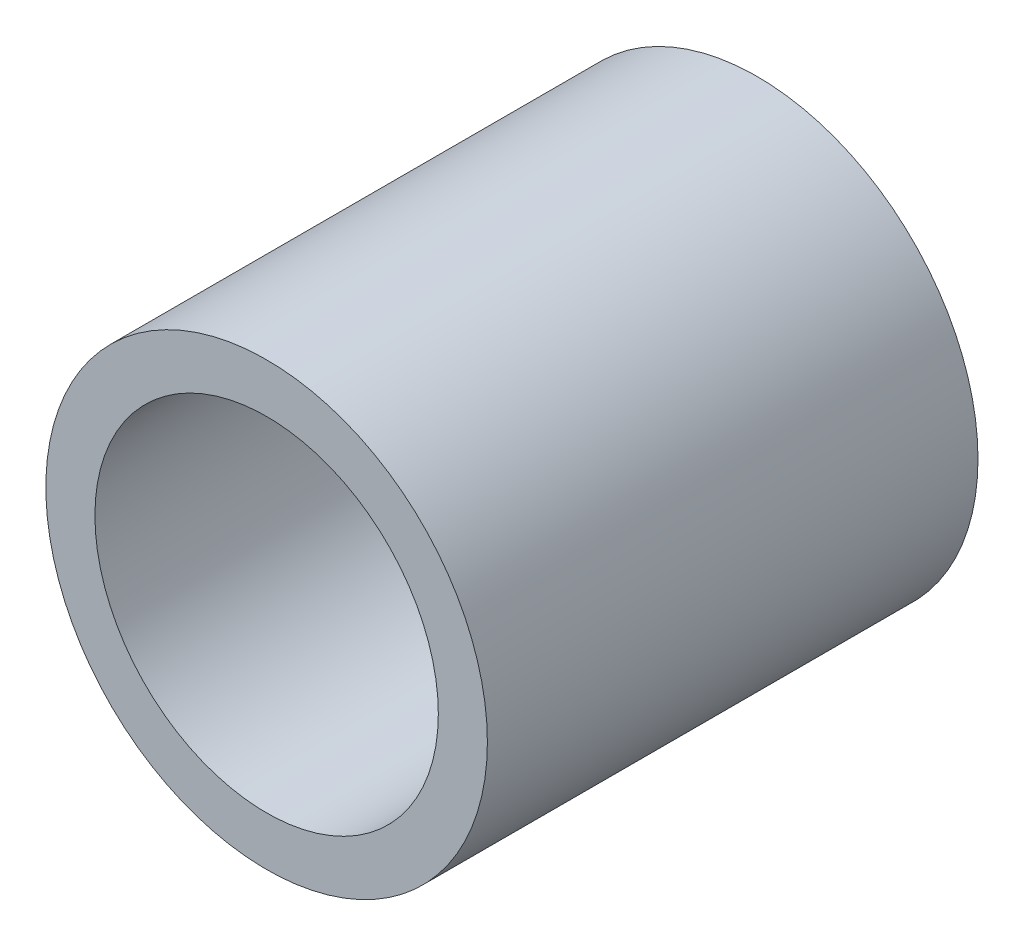
ISO-10303-21;
HEADER;
FILE_DESCRIPTION(('STEP AP214'),'2;1');
FILE_NAME('part.step','',(''),(''),'','','');
FILE_SCHEMA(('AUTOMOTIVE_DESIGN { 1 0 10303 214 1 1 1 1 }'));
ENDSEC;
DATA;
#1=APPLICATION_CONTEXT('core data for automotive mechanical design processes');
#2=APPLICATION_PROTOCOL_DEFINITION('international standard','automotive_design',2000,#1);
#3=PRODUCT_CONTEXT('',#1,'mechanical');
#4=PRODUCT('Part','Part','',(#3));
#5=PRODUCT_RELATED_PRODUCT_CATEGORY('part','',(#4));
#6=PRODUCT_DEFINITION_FORMATION('','',#4);
#7=PRODUCT_DEFINITION_CONTEXT('part definition',#1,'design');
#8=PRODUCT_DEFINITION('design','',#6,#7);
#9=PRODUCT_DEFINITION_SHAPE('','',#8);
#10=(LENGTH_UNIT() NAMED_UNIT(*) SI_UNIT(.MILLI.,.METRE.));
#11=(NAMED_UNIT(*) PLANE_ANGLE_UNIT() SI_UNIT($,.RADIAN.));
#12=(NAMED_UNIT(*) SI_UNIT($,.STERADIAN.) SOLID_ANGLE_UNIT());
#13=UNCERTAINTY_MEASURE_WITH_UNIT(LENGTH_MEASURE(1.E-05),#10,'distance_accuracy_value','');
#14=(GEOMETRIC_REPRESENTATION_CONTEXT(3) GLOBAL_UNCERTAINTY_ASSIGNED_CONTEXT((#13)) GLOBAL_UNIT_ASSIGNED_CONTEXT((#10,
#11,#12)) REPRESENTATION_CONTEXT('',''));
#15=CARTESIAN_POINT('',(0.,0.,0.));
#16=DIRECTION('',(0.,0.,1.));
#17=DIRECTION('',(1.,0.,0.));
#18=AXIS2_PLACEMENT_3D('',#15,#16,#17);
#19=CARTESIAN_POINT('',(0.,0.,15.875));
#20=DIRECTION('',(0.,0.,1.));
#21=DIRECTION('',(1.,0.,0.));
#22=AXIS2_PLACEMENT_3D('',#19,#20,#21);
#23=PLANE('',#22);
#24=CARTESIAN_POINT('',(0.,0.,15.875));
#25=DIRECTION('',(0.,0.,1.));
#26=DIRECTION('',(1.,0.,0.));
#27=AXIS2_PLACEMENT_3D('',#24,#25,#26);
#28=CIRCLE('',#27,14.2875);
#29=CARTESIAN_POINT('',(14.2875,0.,15.875));
#30=VERTEX_POINT('',#29);
#31=EDGE_CURVE('E10',#30,#30,#28,.T.);
#32=ORIENTED_EDGE('',*,*,#31,.T.);
#33=EDGE_LOOP('',(#32));
#34=FACE_BOUND('',#33,.T.);
#35=CARTESIAN_POINT('',(0.,0.,15.875));
#36=DIRECTION('',(0.,0.,1.));
#37=DIRECTION('',(1.,0.,0.));
#38=AXIS2_PLACEMENT_3D('',#35,#36,#37);
#39=CIRCLE('',#38,11.1125);
#40=CARTESIAN_POINT('',(11.1125,0.,15.875));
#41=VERTEX_POINT('',#40);
#42=EDGE_CURVE('E40',#41,#41,#39,.T.);
#43=ORIENTED_EDGE('',*,*,#42,.F.);
#44=EDGE_LOOP('',(#43));
#45=FACE_BOUND('',#44,.T.);
#46=ADVANCED_FACE('F29',(#34,#45),#23,.T.);
#47=CARTESIAN_POINT('',(0.,0.,-15.875));
#48=DIRECTION('',(0.,0.,1.));
#49=DIRECTION('',(1.,0.,0.));
#50=AXIS2_PLACEMENT_3D('',#47,#48,#49);
#51=PLANE('',#50);
#52=CARTESIAN_POINT('',(0.,0.,-15.875));
#53=DIRECTION('',(0.,0.,1.));
#54=DIRECTION('',(1.,0.,0.));
#55=AXIS2_PLACEMENT_3D('',#52,#53,#54);
#56=CIRCLE('',#55,14.2875);
#57=CARTESIAN_POINT('',(14.2875,0.,-15.875));
#58=VERTEX_POINT('',#57);
#59=EDGE_CURVE('E33',#58,#58,#56,.T.);
#60=ORIENTED_EDGE('',*,*,#59,.F.);
#61=EDGE_LOOP('',(#60));
#62=FACE_BOUND('',#61,.T.);
#63=CARTESIAN_POINT('',(0.,0.,-15.875));
#64=DIRECTION('',(0.,0.,1.));
#65=DIRECTION('',(1.,0.,0.));
#66=AXIS2_PLACEMENT_3D('',#63,#64,#65);
#67=CIRCLE('',#66,11.1125);
#68=CARTESIAN_POINT('',(11.1125,0.,-15.875));
#69=VERTEX_POINT('',#68);
#70=EDGE_CURVE('E42',#69,#69,#67,.T.);
#71=ORIENTED_EDGE('',*,*,#70,.T.);
#72=EDGE_LOOP('',(#71));
#73=FACE_BOUND('',#72,.T.);
#74=ADVANCED_FACE('F52',(#62,#73),#51,.F.);
#75=CARTESIAN_POINT('',(0.,0.,15.875));
#76=DIRECTION('',(0.,0.,-1.));
#77=DIRECTION('',(-1.,0.,0.));
#78=AXIS2_PLACEMENT_3D('',#75,#76,#77);
#79=CYLINDRICAL_SURFACE('',#78,14.2875);
#80=ORIENTED_EDGE('',*,*,#31,.F.);
#81=EDGE_LOOP('',(#80));
#82=FACE_BOUND('',#81,.T.);
#83=ORIENTED_EDGE('',*,*,#59,.T.);
#84=EDGE_LOOP('',(#83));
#85=FACE_BOUND('',#84,.T.);
#86=ADVANCED_FACE('F31',(#82,#85),#79,.T.);
#87=CARTESIAN_POINT('',(0.,0.,15.875));
#88=DIRECTION('',(0.,0.,-1.));
#89=DIRECTION('',(-1.,0.,0.));
#90=AXIS2_PLACEMENT_3D('',#87,#88,#89);
#91=CYLINDRICAL_SURFACE('',#90,11.1125);
#92=ORIENTED_EDGE('',*,*,#42,.T.);
#93=EDGE_LOOP('',(#92));
#94=FACE_BOUND('',#93,.T.);
#95=ORIENTED_EDGE('',*,*,#70,.F.);
#96=EDGE_LOOP('',(#95));
#97=FACE_BOUND('',#96,.T.);
#98=ADVANCED_FACE('F48',(#94,#97),#91,.F.);
#99=CLOSED_SHELL('',(#46,#74,#86,#98));
#100=MANIFOLD_SOLID_BREP('B2',#99);
#101=ADVANCED_BREP_SHAPE_REPRESENTATION('',(#18,#100),#14);
#102=SHAPE_DEFINITION_REPRESENTATION(#9,#101);
ENDSEC;
END-ISO-10303-21;
